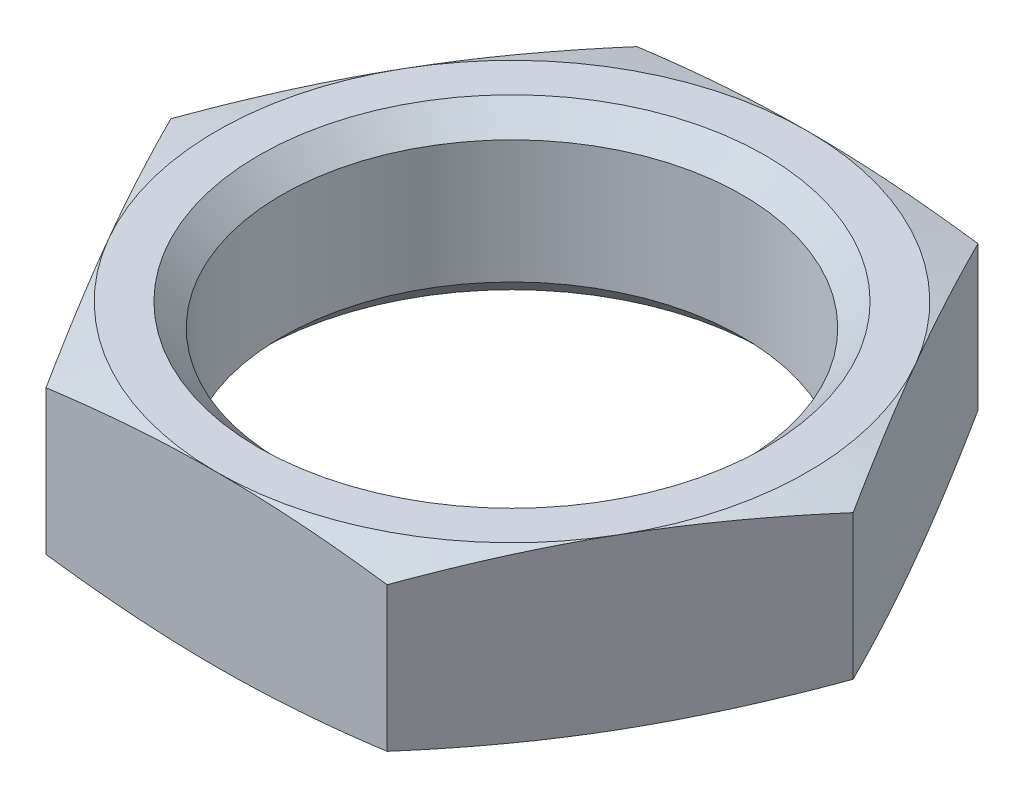
ISO-10303-21;
HEADER;
FILE_DESCRIPTION(('STEP AP214'),'2;1');
FILE_NAME('part.step','',(''),(''),'','','');
FILE_SCHEMA(('AUTOMOTIVE_DESIGN { 1 0 10303 214 1 1 1 1 }'));
ENDSEC;
DATA;
#1=APPLICATION_CONTEXT('core data for automotive mechanical design processes');
#2=APPLICATION_PROTOCOL_DEFINITION('international standard','automotive_design',2000,#1);
#3=PRODUCT_CONTEXT('',#1,'mechanical');
#4=PRODUCT('Part','Part','',(#3));
#5=PRODUCT_RELATED_PRODUCT_CATEGORY('part','',(#4));
#6=PRODUCT_DEFINITION_FORMATION('','',#4);
#7=PRODUCT_DEFINITION_CONTEXT('part definition',#1,'design');
#8=PRODUCT_DEFINITION('design','',#6,#7);
#9=PRODUCT_DEFINITION_SHAPE('','',#8);
#10=(LENGTH_UNIT() NAMED_UNIT(*) SI_UNIT(.MILLI.,.METRE.));
#11=(NAMED_UNIT(*) PLANE_ANGLE_UNIT() SI_UNIT($,.RADIAN.));
#12=(NAMED_UNIT(*) SI_UNIT($,.STERADIAN.) SOLID_ANGLE_UNIT());
#13=UNCERTAINTY_MEASURE_WITH_UNIT(LENGTH_MEASURE(1.E-05),#10,'distance_accuracy_value','');
#14=(GEOMETRIC_REPRESENTATION_CONTEXT(3) GLOBAL_UNCERTAINTY_ASSIGNED_CONTEXT((#13)) GLOBAL_UNIT_ASSIGNED_CONTEXT((#10,
#11,#12)) REPRESENTATION_CONTEXT('',''));
#15=CARTESIAN_POINT('',(0.,0.,0.));
#16=DIRECTION('',(0.,0.,1.));
#17=DIRECTION('',(1.,0.,0.));
#18=AXIS2_PLACEMENT_3D('',#15,#16,#17);
#19=CARTESIAN_POINT('',(0.,22.624871130596,0.));
#20=DIRECTION('',(0.,-1.,0.));
#21=DIRECTION('',(0.,0.,-1.));
#22=AXIS2_PLACEMENT_3D('',#19,#20,#21);
#23=CONICAL_SURFACE('',#22,8.4,1.30899693899546);
#24=CARTESIAN_POINT('',(-10.6911322640009,21.4515481615371,-7.));
#25=CARTESIAN_POINT('',(-10.3735623819273,21.5227195195899,-7.));
#26=CARTESIAN_POINT('',(-10.0557938698741,21.5930204486743,-7.));
#27=CARTESIAN_POINT('',(-9.41976203586877,21.7314116126823,-7.));
#28=CARTESIAN_POINT('',(-9.10149869316679,21.7995017521285,-7.));
#29=CARTESIAN_POINT('',(-8.46409454984814,21.9330607549853,-7.));
#30=CARTESIAN_POINT('',(-8.14495319474251,21.9985269815388,-7.));
#31=CARTESIAN_POINT('',(-7.50600622241134,22.1261315216518,-7.));
#32=CARTESIAN_POINT('',(-7.18620061081572,22.1882698632982,-7.));
#33=CARTESIAN_POINT('',(-6.54836011041523,22.3079472769157,-7.));
#34=CARTESIAN_POINT('',(-6.23033138028991,22.3655190112718,-7.));
#35=CARTESIAN_POINT('',(-5.5934064347611,22.4756361833584,-7.));
#36=CARTESIAN_POINT('',(-5.27451023860448,22.5281817316867,-7.));
#37=CARTESIAN_POINT('',(-4.63578845540351,22.6270634183882,-7.));
#38=CARTESIAN_POINT('',(-4.31596298773532,22.6734003211778,-7.));
#39=CARTESIAN_POINT('',(-3.67529430465846,22.7584992441129,-7.));
#40=CARTESIAN_POINT('',(-3.3544510882966,22.7972612571618,-7.));
#41=CARTESIAN_POINT('',(-2.70812720060484,22.8661127994206,-7.));
#42=CARTESIAN_POINT('',(-2.3826353120585,22.8960985929274,-7.));
#43=CARTESIAN_POINT('',(-1.73083324337082,22.9453291088546,-7.));
#44=CARTESIAN_POINT('',(-1.40452308216818,22.9645740776054,-7.));
#45=CARTESIAN_POINT('',(-0.751557811017229,22.9912004998162,-7.));
#46=CARTESIAN_POINT('',(-0.424902925429233,22.9985873445018,-7.));
#47=CARTESIAN_POINT('',(0.228453821879662,23.0010433607367,-7.));
#48=CARTESIAN_POINT('',(0.555155683559823,22.9961125429043,-7.));
#49=CARTESIAN_POINT('',(1.20933616652606,22.9742105261694,-7.));
#50=CARTESIAN_POINT('',(1.53681329485983,22.9571956279751,-7.));
#51=CARTESIAN_POINT('',(2.19099740166919,22.9120966869003,-7.));
#52=CARTESIAN_POINT('',(2.51770436293296,22.8840123989549,-7.));
#53=CARTESIAN_POINT('',(3.17034538770756,22.8181933032549,-7.));
#54=CARTESIAN_POINT('',(3.49627880618637,22.7804521975215,-7.));
#55=CARTESIAN_POINT('',(4.14709670501514,22.6968898971319,-7.));
#56=CARTESIAN_POINT('',(4.47198118206855,22.6510686771071,-7.));
#57=CARTESIAN_POINT('',(5.09925619444394,22.5560650006586,-7.));
#58=CARTESIAN_POINT('',(5.40171153305506,22.5073061005869,-7.));
#59=CARTESIAN_POINT('',(6.00582502224207,22.4050554163927,-7.));
#60=CARTESIAN_POINT('',(6.30748315083698,22.3515635031432,-7.));
#61=CARTESIAN_POINT('',(6.9101125934313,22.2407127044841,-7.));
#62=CARTESIAN_POINT('',(7.2110838433774,22.1833534725392,-7.));
#63=CARTESIAN_POINT('',(7.8124081922024,22.0654740226152,-7.));
#64=CARTESIAN_POINT('',(8.11276128301989,22.0049537636812,-7.));
#65=CARTESIAN_POINT('',(9.01315912682122,21.8195102166111,-7.));
#66=CARTESIAN_POINT('',(9.61240855747611,21.6907293518093,-7.));
#67=CARTESIAN_POINT('',(10.8093137785155,21.4261960838304,-7.));
#68=CARTESIAN_POINT('',(11.4069696599747,21.2904440884596,-7.));
#69=CARTESIAN_POINT('',(12.5952742494381,21.0153870041733,-7.));
#70=CARTESIAN_POINT('',(13.1859341039434,20.8761299376637,-7.));
#71=CARTESIAN_POINT('',(14.3664297891116,20.5941294395364,-7.));
#72=CARTESIAN_POINT('',(14.9562656045554,20.4513859444052,-7.));
#73=CARTESIAN_POINT('',(16.1345791413491,20.1635007551481,-7.));
#74=CARTESIAN_POINT('',(16.7230576404083,20.0183622378419,-7.));
#75=CARTESIAN_POINT('',(17.8995020368502,19.7261033684098,-7.));
#76=CARTESIAN_POINT('',(18.4874679505085,19.5789830818445,-7.));
#77=CARTESIAN_POINT('',(19.0752552110418,19.4311609668169,-7.));
#78=B_SPLINE_CURVE_WITH_KNOTS('',3,(#24,#25,#26,#27,#28,#29,#30,#31,#32,#33,#34,#35,#36,#37,#38,
#39,#40,#41,#42,#43,#44,#45,#46,#47,#48,#49,#50,#51,#52,#53,#54,#55,#56,#57,#58,#59,#60,#61,#62,
#63,#64,#65,#66,#67,#68,#69,#70,#71,#72,#73,#74,#75,#76,#77),.UNSPECIFIED.,.F.,.F.,(4,2,2,2,2,2,
2,2,2,2,2,2,2,2,2,2,2,2,2,2,2,2,2,2,2,2,4),(0.,0.976346090838124,1.9527342912871,
2.93008027829377,3.9074180153295,4.87697901809727,5.84651868143612,6.81593886390814,
7.78535995458276,8.76581538939093,9.7462483374918,10.7262354112185,11.7062216401572,
12.6897699278962,13.6733399916105,14.6575531618957,15.6417694223039,16.560806166761,
17.4798679922853,18.3990122810862,19.3181684814429,21.1568895489242,22.9955031747617,
24.816049750823,26.6366295171704,28.4549626359596,30.2732357478842),.UNSPECIFIED.);
#79=CARTESIAN_POINT('',(0.,23.,-7.));
#80=VERTEX_POINT('',#79);
#81=CARTESIAN_POINT('',(-4.0414518843274,22.709836809708,-7.));
#82=VERTEX_POINT('',#81);
#83=EDGE_CURVE('E194',#80,#82,#78,.F.);
#84=ORIENTED_EDGE('',*,*,#83,.T.);
#85=CARTESIAN_POINT('',(-4.04133641427356,22.7098058689373,-7.0002));
#86=CARTESIAN_POINT('',(-4.20917732789738,22.7547976495157,-6.70949101001476));
#87=CARTESIAN_POINT('',(-4.37732255633956,22.7956427629535,-6.41825493130264));
#88=CARTESIAN_POINT('',(-4.71420683115924,22.8674037986896,-5.83475425104396));
#89=CARTESIAN_POINT('',(-4.88294609068361,22.898315687944,-5.5424892803162));
#90=CARTESIAN_POINT('',(-5.2199953606491,22.948405659577,-4.95870282008198));
#91=CARTESIAN_POINT('',(-5.38830309196278,22.9676434763867,-4.66718527814003));
#92=CARTESIAN_POINT('',(-5.72513318957669,22.993439419987,-4.08377843555436));
#93=CARTESIAN_POINT('',(-5.89365550803389,23.,-3.79188921777718));
#94=CARTESIAN_POINT('',(-6.23070014494831,23.,-3.20811078222282));
#95=CARTESIAN_POINT('',(-6.39922246340551,22.993439419987,-2.91622156444564));
#96=CARTESIAN_POINT('',(-6.73605256101942,22.9676434763867,-2.33281472185997));
#97=CARTESIAN_POINT('',(-6.9043602923331,22.948405659577,-2.04129717991802));
#98=CARTESIAN_POINT('',(-7.24140956229859,22.898315687944,-1.4575107196838));
#99=CARTESIAN_POINT('',(-7.41014882182296,22.8674037986896,-1.16524574895603));
#100=CARTESIAN_POINT('',(-7.74703309664264,22.7956427629535,-0.58174506869736));
#101=CARTESIAN_POINT('',(-7.91517832508482,22.7547976495157,-0.290508989985233));
#102=CARTESIAN_POINT('',(-8.08301923870864,22.7098058689373,0.000200000000002879));
#103=B_SPLINE_CURVE_WITH_KNOTS('',3,(#85,#86,#87,#88,#89,#90,#91,#92,#93,#94,#95,#96,#97,#98,
#99,#100,#101,#102),.UNSPECIFIED.,.F.,.F.,(4,2,2,2,2,2,2,2,4),(0.,1.0161038968205,
2.03261982791319,3.04388955407877,4.05496356583083,5.06603757758289,6.07730730374847,
7.09382323484116,8.10992713166166),.UNSPECIFIED.);
#104=CARTESIAN_POINT('',(-6.06217782649109,23.,-3.50000000000002));
#105=VERTEX_POINT('',#104);
#106=EDGE_CURVE('E303',#82,#105,#103,.T.);
#107=ORIENTED_EDGE('',*,*,#106,.T.);
#108=CARTESIAN_POINT('',(0.,23.,0.));
#109=DIRECTION('',(0.,1.,0.));
#110=DIRECTION('',(0.,0.,1.));
#111=AXIS2_PLACEMENT_3D('',#108,#109,#110);
#112=CIRCLE('',#111,7.);
#113=EDGE_CURVE('E306',#80,#105,#112,.T.);
#114=ORIENTED_EDGE('',*,*,#113,.F.);
#115=EDGE_LOOP('',(#84,#107,#114));
#116=FACE_BOUND('',#115,.T.);
#117=ADVANCED_FACE('F39',(#116),#23,.T.);
#118=CARTESIAN_POINT('',(-6.06217782649109,23.,3.50000000000003));
#119=VERTEX_POINT('',#118);
#120=EDGE_CURVE('E332',#105,#119,#112,.T.);
#121=ORIENTED_EDGE('',*,*,#120,.F.);
#122=CARTESIAN_POINT('',(-8.0829037686548,22.709836809708,0.));
#123=VERTEX_POINT('',#122);
#124=EDGE_CURVE('E243',#105,#123,#103,.T.);
#125=ORIENTED_EDGE('',*,*,#124,.T.);
#126=CARTESIAN_POINT('',(-8.08301923870864,22.7098058689373,-0.000199999999999112));
#127=CARTESIAN_POINT('',(-7.91517832508482,22.7547976495157,0.290508989985238));
#128=CARTESIAN_POINT('',(-7.74703309664264,22.7956427629535,0.581745068697364));
#129=CARTESIAN_POINT('',(-7.41014882182296,22.8674037986896,1.16524574895603));
#130=CARTESIAN_POINT('',(-7.24140956229859,22.898315687944,1.4575107196838));
#131=CARTESIAN_POINT('',(-6.9043602923331,22.948405659577,2.04129717991802));
#132=CARTESIAN_POINT('',(-6.73605256101942,22.9676434763867,2.33281472185997));
#133=CARTESIAN_POINT('',(-6.39922246340551,22.993439419987,2.91622156444564));
#134=CARTESIAN_POINT('',(-6.23070014494831,23.,3.20811078222282));
#135=CARTESIAN_POINT('',(-5.89365550803389,23.,3.79188921777718));
#136=CARTESIAN_POINT('',(-5.72513318957669,22.993439419987,4.08377843555436));
#137=CARTESIAN_POINT('',(-5.38830309196278,22.9676434763867,4.66718527814003));
#138=CARTESIAN_POINT('',(-5.2199953606491,22.948405659577,4.95870282008198));
#139=CARTESIAN_POINT('',(-4.88294609068361,22.898315687944,5.5424892803162));
#140=CARTESIAN_POINT('',(-4.71420683115924,22.8674037986896,5.83475425104397));
#141=CARTESIAN_POINT('',(-4.37732255633956,22.7956427629535,6.41825493130264));
#142=CARTESIAN_POINT('',(-4.20917732789738,22.7547976495157,6.70949101001476));
#143=CARTESIAN_POINT('',(-4.04133641427356,22.7098058689373,7.0002));
#144=B_SPLINE_CURVE_WITH_KNOTS('',3,(#126,#127,#128,#129,#130,#131,#132,#133,#134,#135,#136,
#137,#138,#139,#140,#141,#142,#143),.UNSPECIFIED.,.F.,.F.,(4,2,2,2,2,2,2,2,4),(0.,
1.01610389682049,2.03261982791319,3.04388955407876,4.05496356583083,5.06603757758289,
6.07730730374846,7.09382323484116,8.10992713166165),.UNSPECIFIED.);
#145=EDGE_CURVE('E241',#123,#119,#144,.T.);
#146=ORIENTED_EDGE('',*,*,#145,.T.);
#147=EDGE_LOOP('',(#121,#125,#146));
#148=FACE_BOUND('',#147,.T.);
#149=ADVANCED_FACE('F293',(#148),#23,.T.);
#150=CARTESIAN_POINT('',(0.,23.,7.));
#151=VERTEX_POINT('',#150);
#152=EDGE_CURVE('E167',#119,#151,#112,.T.);
#153=ORIENTED_EDGE('',*,*,#152,.F.);
#154=CARTESIAN_POINT('',(-4.0414518843274,22.709836809708,7.));
#155=VERTEX_POINT('',#154);
#156=EDGE_CURVE('E234',#119,#155,#144,.T.);
#157=ORIENTED_EDGE('',*,*,#156,.T.);
#158=CARTESIAN_POINT('',(-10.6911322640009,21.4515481615371,7.));
#159=CARTESIAN_POINT('',(-10.3735623819273,21.5227195195899,7.));
#160=CARTESIAN_POINT('',(-10.0557938698741,21.5930204486743,7.));
#161=CARTESIAN_POINT('',(-9.41976203586877,21.7314116126823,7.));
#162=CARTESIAN_POINT('',(-9.10149869316679,21.7995017521285,7.));
#163=CARTESIAN_POINT('',(-8.46409454984814,21.9330607549853,7.));
#164=CARTESIAN_POINT('',(-8.14495319474251,21.9985269815388,7.));
#165=CARTESIAN_POINT('',(-7.50600622241134,22.1261315216518,7.));
#166=CARTESIAN_POINT('',(-7.18620061081572,22.1882698632982,7.));
#167=CARTESIAN_POINT('',(-6.54836011041523,22.3079472769157,7.));
#168=CARTESIAN_POINT('',(-6.23033138028991,22.3655190112718,7.));
#169=CARTESIAN_POINT('',(-5.5934064347611,22.4756361833584,7.));
#170=CARTESIAN_POINT('',(-5.27451023860448,22.5281817316867,7.));
#171=CARTESIAN_POINT('',(-4.63578845540351,22.6270634183882,7.));
#172=CARTESIAN_POINT('',(-4.31596298773532,22.6734003211778,7.));
#173=CARTESIAN_POINT('',(-3.67529430465846,22.7584992441129,7.));
#174=CARTESIAN_POINT('',(-3.3544510882966,22.7972612571618,7.));
#175=CARTESIAN_POINT('',(-2.70812720060484,22.8661127994206,7.));
#176=CARTESIAN_POINT('',(-2.3826353120585,22.8960985929274,7.));
#177=CARTESIAN_POINT('',(-1.73083324337082,22.9453291088546,7.));
#178=CARTESIAN_POINT('',(-1.40452308216818,22.9645740776054,7.));
#179=CARTESIAN_POINT('',(-0.751557811017229,22.9912004998162,7.));
#180=CARTESIAN_POINT('',(-0.424902925429233,22.9985873445018,7.));
#181=CARTESIAN_POINT('',(0.228453821879662,23.0010433607367,7.));
#182=CARTESIAN_POINT('',(0.555155683559823,22.9961125429043,7.));
#183=CARTESIAN_POINT('',(1.20933616652606,22.9742105261694,7.));
#184=CARTESIAN_POINT('',(1.53681329485983,22.9571956279751,7.));
#185=CARTESIAN_POINT('',(2.19099740166919,22.9120966869003,7.));
#186=CARTESIAN_POINT('',(2.51770436293296,22.8840123989549,7.));
#187=CARTESIAN_POINT('',(3.17034538770756,22.8181933032549,7.));
#188=CARTESIAN_POINT('',(3.49627880618637,22.7804521975215,7.));
#189=CARTESIAN_POINT('',(4.14709670501514,22.6968898971319,7.));
#190=CARTESIAN_POINT('',(4.47198118206855,22.6510686771071,7.));
#191=CARTESIAN_POINT('',(5.09925619444394,22.5560650006586,7.));
#192=CARTESIAN_POINT('',(5.40171153305506,22.5073061005869,7.));
#193=CARTESIAN_POINT('',(6.00582502224207,22.4050554163927,7.));
#194=CARTESIAN_POINT('',(6.30748315083698,22.3515635031432,7.));
#195=CARTESIAN_POINT('',(6.9101125934313,22.2407127044841,7.));
#196=CARTESIAN_POINT('',(7.2110838433774,22.1833534725392,7.));
#197=CARTESIAN_POINT('',(7.8124081922024,22.0654740226152,7.));
#198=CARTESIAN_POINT('',(8.11276128301989,22.0049537636812,7.));
#199=CARTESIAN_POINT('',(9.01315912682122,21.8195102166111,7.));
#200=CARTESIAN_POINT('',(9.61240855747611,21.6907293518093,7.));
#201=CARTESIAN_POINT('',(10.8093137785155,21.4261960838304,7.));
#202=CARTESIAN_POINT('',(11.4069696599747,21.2904440884596,7.));
#203=CARTESIAN_POINT('',(12.5952742494381,21.0153870041733,7.));
#204=CARTESIAN_POINT('',(13.1859341039434,20.8761299376637,7.));
#205=CARTESIAN_POINT('',(14.3664297891116,20.5941294395364,7.));
#206=CARTESIAN_POINT('',(14.9562656045554,20.4513859444052,7.));
#207=CARTESIAN_POINT('',(16.1345791413491,20.1635007551481,7.));
#208=CARTESIAN_POINT('',(16.7230576404083,20.0183622378419,7.));
#209=CARTESIAN_POINT('',(17.8995020368502,19.7261033684098,7.));
#210=CARTESIAN_POINT('',(18.4874679505085,19.5789830818445,7.));
#211=CARTESIAN_POINT('',(19.0752552110418,19.4311609668169,7.));
#212=B_SPLINE_CURVE_WITH_KNOTS('',3,(#158,#159,#160,#161,#162,#163,#164,#165,#166,#167,#168,
#169,#170,#171,#172,#173,#174,#175,#176,#177,#178,#179,#180,#181,#182,#183,#184,#185,#186,#187,
#188,#189,#190,#191,#192,#193,#194,#195,#196,#197,#198,#199,#200,#201,#202,#203,#204,#205,#206,
#207,#208,#209,#210,#211),.UNSPECIFIED.,.F.,.F.,(4,2,2,2,2,2,2,2,2,2,2,2,2,2,2,2,2,2,2,2,2,2,2,
2,2,2,4),(0.,0.976346090838124,1.9527342912871,2.93008027829377,3.9074180153295,
4.87697901809727,5.84651868143612,6.81593886390814,7.78535995458276,8.76581538939093,
9.7462483374918,10.7262354112185,11.7062216401572,12.6897699278962,13.6733399916105,
14.6575531618957,15.6417694223039,16.560806166761,17.4798679922853,18.3990122810862,
19.3181684814429,21.1568895489242,22.9955031747617,24.816049750823,26.6366295171704,
28.4549626359596,30.2732357478842),.UNSPECIFIED.);
#213=EDGE_CURVE('E242',#155,#151,#212,.T.);
#214=ORIENTED_EDGE('',*,*,#213,.T.);
#215=EDGE_LOOP('',(#153,#157,#214));
#216=FACE_BOUND('',#215,.T.);
#217=ADVANCED_FACE('F299',(#216),#23,.T.);
#218=CARTESIAN_POINT('',(6.06217782649109,23.,3.50000000000002));
#219=VERTEX_POINT('',#218);
#220=EDGE_CURVE('E138',#151,#219,#112,.T.);
#221=ORIENTED_EDGE('',*,*,#220,.F.);
#222=CARTESIAN_POINT('',(4.0414518843274,22.709836809708,7.));
#223=VERTEX_POINT('',#222);
#224=EDGE_CURVE('E228',#151,#223,#212,.T.);
#225=ORIENTED_EDGE('',*,*,#224,.T.);
#226=CARTESIAN_POINT('',(4.04133641427356,22.7098058689373,7.0002));
#227=CARTESIAN_POINT('',(4.20917732789738,22.7547976495157,6.70949101001476));
#228=CARTESIAN_POINT('',(4.37732255633956,22.7956427629535,6.41825493130264));
#229=CARTESIAN_POINT('',(4.71420683115924,22.8674037986896,5.83475425104396));
#230=CARTESIAN_POINT('',(4.88294609068361,22.898315687944,5.5424892803162));
#231=CARTESIAN_POINT('',(5.2199953606491,22.948405659577,4.95870282008198));
#232=CARTESIAN_POINT('',(5.38830309196278,22.9676434763867,4.66718527814003));
#233=CARTESIAN_POINT('',(5.72513318957669,22.993439419987,4.08377843555436));
#234=CARTESIAN_POINT('',(5.89365550803389,23.,3.79188921777718));
#235=CARTESIAN_POINT('',(6.23070014494831,23.,3.20811078222282));
#236=CARTESIAN_POINT('',(6.39922246340551,22.993439419987,2.91622156444564));
#237=CARTESIAN_POINT('',(6.73605256101942,22.9676434763867,2.33281472185997));
#238=CARTESIAN_POINT('',(6.9043602923331,22.948405659577,2.04129717991802));
#239=CARTESIAN_POINT('',(7.24140956229859,22.898315687944,1.4575107196838));
#240=CARTESIAN_POINT('',(7.41014882182296,22.8674037986896,1.16524574895603));
#241=CARTESIAN_POINT('',(7.74703309664264,22.7956427629535,0.58174506869736));
#242=CARTESIAN_POINT('',(7.91517832508482,22.7547976495157,0.290508989985233));
#243=CARTESIAN_POINT('',(8.08301923870864,22.7098058689373,-0.000200000000002879));
#244=B_SPLINE_CURVE_WITH_KNOTS('',3,(#226,#227,#228,#229,#230,#231,#232,#233,#234,#235,#236,
#237,#238,#239,#240,#241,#242,#243),.UNSPECIFIED.,.F.,.F.,(4,2,2,2,2,2,2,2,4),(0.,
1.0161038968205,2.03261982791319,3.04388955407877,4.05496356583083,5.06603757758289,
6.07730730374847,7.09382323484116,8.10992713166166),.UNSPECIFIED.);
#245=EDGE_CURVE('E318',#223,#219,#244,.T.);
#246=ORIENTED_EDGE('',*,*,#245,.T.);
#247=EDGE_LOOP('',(#221,#225,#246));
#248=FACE_BOUND('',#247,.T.);
#249=ADVANCED_FACE('F333',(#248),#23,.T.);
#250=CARTESIAN_POINT('',(6.06217782649109,23.,-3.50000000000003));
#251=VERTEX_POINT('',#250);
#252=EDGE_CURVE('E172',#219,#251,#112,.T.);
#253=ORIENTED_EDGE('',*,*,#252,.F.);
#254=CARTESIAN_POINT('',(8.0829037686548,22.709836809708,0.));
#255=VERTEX_POINT('',#254);
#256=EDGE_CURVE('E222',#219,#255,#244,.T.);
#257=ORIENTED_EDGE('',*,*,#256,.T.);
#258=CARTESIAN_POINT('',(8.08301923870864,22.7098058689373,0.000199999999999112));
#259=CARTESIAN_POINT('',(7.91517832508482,22.7547976495157,-0.290508989985238));
#260=CARTESIAN_POINT('',(7.74703309664264,22.7956427629535,-0.581745068697364));
#261=CARTESIAN_POINT('',(7.41014882182296,22.8674037986896,-1.16524574895603));
#262=CARTESIAN_POINT('',(7.24140956229859,22.898315687944,-1.4575107196838));
#263=CARTESIAN_POINT('',(6.9043602923331,22.948405659577,-2.04129717991802));
#264=CARTESIAN_POINT('',(6.73605256101942,22.9676434763867,-2.33281472185997));
#265=CARTESIAN_POINT('',(6.39922246340551,22.993439419987,-2.91622156444564));
#266=CARTESIAN_POINT('',(6.23070014494831,23.,-3.20811078222282));
#267=CARTESIAN_POINT('',(5.89365550803389,23.,-3.79188921777718));
#268=CARTESIAN_POINT('',(5.72513318957669,22.993439419987,-4.08377843555436));
#269=CARTESIAN_POINT('',(5.38830309196278,22.9676434763867,-4.66718527814003));
#270=CARTESIAN_POINT('',(5.2199953606491,22.948405659577,-4.95870282008198));
#271=CARTESIAN_POINT('',(4.88294609068361,22.898315687944,-5.5424892803162));
#272=CARTESIAN_POINT('',(4.71420683115924,22.8674037986896,-5.83475425104397));
#273=CARTESIAN_POINT('',(4.37732255633956,22.7956427629535,-6.41825493130264));
#274=CARTESIAN_POINT('',(4.20917732789738,22.7547976495157,-6.70949101001476));
#275=CARTESIAN_POINT('',(4.04133641427356,22.7098058689373,-7.0002));
#276=B_SPLINE_CURVE_WITH_KNOTS('',3,(#258,#259,#260,#261,#262,#263,#264,#265,#266,#267,#268,
#269,#270,#271,#272,#273,#274,#275),.UNSPECIFIED.,.F.,.F.,(4,2,2,2,2,2,2,2,4),(0.,
1.01610389682049,2.03261982791319,3.04388955407876,4.05496356583083,5.06603757758289,
6.07730730374846,7.09382323484116,8.10992713166165),.UNSPECIFIED.);
#277=EDGE_CURVE('E313',#255,#251,#276,.T.);
#278=ORIENTED_EDGE('',*,*,#277,.T.);
#279=EDGE_LOOP('',(#253,#257,#278));
#280=FACE_BOUND('',#279,.T.);
#281=ADVANCED_FACE('F215',(#280),#23,.T.);
#282=CARTESIAN_POINT('',(0.,19.,0.));
#283=DIRECTION('',(0.,1.,0.));
#284=DIRECTION('',(0.,0.,1.));
#285=AXIS2_PLACEMENT_3D('',#282,#283,#284);
#286=CONICAL_SURFACE('',#285,7.,1.30899693899546);
#287=CARTESIAN_POINT('',(8.08301923870864,19.2901941310627,-0.000200000000001046));
#288=CARTESIAN_POINT('',(7.91517832508482,19.2452023504843,0.290508989985236));
#289=CARTESIAN_POINT('',(7.74703309664264,19.2043572370465,0.581745068697362));
#290=CARTESIAN_POINT('',(7.41014882182296,19.1325962013104,1.16524574895603));
#291=CARTESIAN_POINT('',(7.24140956229859,19.101684312056,1.4575107196838));
#292=CARTESIAN_POINT('',(6.9043602923331,19.051594340423,2.04129717991802));
#293=CARTESIAN_POINT('',(6.73605256101942,19.0323565236133,2.33281472185997));
#294=CARTESIAN_POINT('',(6.39922246340551,19.006560580013,2.91622156444564));
#295=CARTESIAN_POINT('',(6.23070014494831,19.,3.20811078222282));
#296=CARTESIAN_POINT('',(5.89365550803389,19.,3.79188921777718));
#297=CARTESIAN_POINT('',(5.72513318957669,19.006560580013,4.08377843555436));
#298=CARTESIAN_POINT('',(5.38830309196278,19.0323565236133,4.66718527814003));
#299=CARTESIAN_POINT('',(5.2199953606491,19.051594340423,4.95870282008198));
#300=CARTESIAN_POINT('',(4.88294609068361,19.101684312056,5.5424892803162));
#301=CARTESIAN_POINT('',(4.71420683115924,19.1325962013104,5.83475425104396));
#302=CARTESIAN_POINT('',(4.37732255633956,19.2043572370465,6.41825493130264));
#303=CARTESIAN_POINT('',(4.20917732789738,19.2452023504843,6.70949101001476));
#304=CARTESIAN_POINT('',(4.04133641427356,19.2901941310627,7.0002));
#305=B_SPLINE_CURVE_WITH_KNOTS('',3,(#287,#288,#289,#290,#291,#292,#293,#294,#295,#296,#297,
#298,#299,#300,#301,#302,#303,#304),.UNSPECIFIED.,.F.,.F.,(4,2,2,2,2,2,2,2,4),(0.,
1.01610389682049,2.03261982791319,3.04388955407877,4.05496356583083,5.06603757758289,
6.07730730374846,7.09382323484116,8.10992713166165),.UNSPECIFIED.);
#306=CARTESIAN_POINT('',(6.06217782649109,19.,3.50000000000002));
#307=VERTEX_POINT('',#306);
#308=CARTESIAN_POINT('',(4.0414518843274,19.290163190292,7.));
#309=VERTEX_POINT('',#308);
#310=EDGE_CURVE('E275',#307,#309,#305,.T.);
#311=ORIENTED_EDGE('',*,*,#310,.T.);
#312=CARTESIAN_POINT('',(-10.6911322640009,20.5484518384629,7.));
#313=CARTESIAN_POINT('',(-10.3735623819273,20.4772804804101,7.));
#314=CARTESIAN_POINT('',(-10.0557938698741,20.4069795513257,7.));
#315=CARTESIAN_POINT('',(-9.41976203586877,20.2685883873177,7.));
#316=CARTESIAN_POINT('',(-9.1014986931668,20.2004982478715,7.));
#317=CARTESIAN_POINT('',(-8.46409454984815,20.0669392450147,7.));
#318=CARTESIAN_POINT('',(-8.14495319474251,20.0014730184612,7.));
#319=CARTESIAN_POINT('',(-7.50600622241134,19.8738684783482,7.));
#320=CARTESIAN_POINT('',(-7.18620061081572,19.8117301367018,7.));
#321=CARTESIAN_POINT('',(-6.54836011041523,19.6920527230843,7.));
#322=CARTESIAN_POINT('',(-6.23033138028991,19.6344809887282,7.));
#323=CARTESIAN_POINT('',(-5.5934064347611,19.5243638166416,7.));
#324=CARTESIAN_POINT('',(-5.27451023860448,19.4718182683133,7.));
#325=CARTESIAN_POINT('',(-4.63578845540351,19.3729365816118,7.));
#326=CARTESIAN_POINT('',(-4.31596298773532,19.3265996788222,7.));
#327=CARTESIAN_POINT('',(-3.67529430465846,19.2415007558871,7.));
#328=CARTESIAN_POINT('',(-3.3544510882966,19.2027387428382,7.));
#329=CARTESIAN_POINT('',(-2.70812720060484,19.1338872005794,7.));
#330=CARTESIAN_POINT('',(-2.3826353120585,19.1039014070726,7.));
#331=CARTESIAN_POINT('',(-1.73083324337082,19.0546708911454,7.));
#332=CARTESIAN_POINT('',(-1.40452308216818,19.0354259223946,7.));
#333=CARTESIAN_POINT('',(-0.751557811017229,19.0087995001838,7.));
#334=CARTESIAN_POINT('',(-0.424902925429233,19.0014126554982,7.));
#335=CARTESIAN_POINT('',(0.228453821879662,18.9989566392633,7.));
#336=CARTESIAN_POINT('',(0.555155683559823,19.0038874570957,7.));
#337=CARTESIAN_POINT('',(1.20933616652606,19.0257894738306,7.));
#338=CARTESIAN_POINT('',(1.53681329485983,19.0428043720249,7.));
#339=CARTESIAN_POINT('',(2.19099740166919,19.0879033130997,7.));
#340=CARTESIAN_POINT('',(2.51770436293296,19.1159876010451,7.));
#341=CARTESIAN_POINT('',(3.17034538770756,19.1818066967451,7.));
#342=CARTESIAN_POINT('',(3.49627880618637,19.2195478024785,7.));
#343=CARTESIAN_POINT('',(4.14709670501514,19.3031101028681,7.));
#344=CARTESIAN_POINT('',(4.47198118206855,19.3489313228929,7.));
#345=CARTESIAN_POINT('',(5.09925619444394,19.4439349993414,7.));
#346=CARTESIAN_POINT('',(5.40171153305506,19.4926938994131,7.));
#347=CARTESIAN_POINT('',(6.00582502224207,19.5949445836073,7.));
#348=CARTESIAN_POINT('',(6.30748315083698,19.6484364968568,7.));
#349=CARTESIAN_POINT('',(6.9101125934313,19.7592872955159,7.));
#350=CARTESIAN_POINT('',(7.2110838433774,19.8166465274608,7.));
#351=CARTESIAN_POINT('',(7.8124081922024,19.9345259773848,7.));
#352=CARTESIAN_POINT('',(8.11276128301989,19.9950462363188,7.));
#353=CARTESIAN_POINT('',(9.01315912682122,20.1804897833889,7.));
#354=CARTESIAN_POINT('',(9.61240855747611,20.3092706481907,7.));
#355=CARTESIAN_POINT('',(10.8093137785155,20.5738039161696,7.));
#356=CARTESIAN_POINT('',(11.4069696599747,20.7095559115404,7.));
#357=CARTESIAN_POINT('',(12.5952742494381,20.9846129958267,7.));
#358=CARTESIAN_POINT('',(13.1859341039434,21.1238700623363,7.));
#359=CARTESIAN_POINT('',(14.3664297891116,21.4058705604636,7.));
#360=CARTESIAN_POINT('',(14.9562656045554,21.5486140555948,7.));
#361=CARTESIAN_POINT('',(16.1345791413491,21.8364992448519,7.));
#362=CARTESIAN_POINT('',(16.7230576404083,21.9816377621581,7.));
#363=CARTESIAN_POINT('',(17.8995020368502,22.2738966315902,7.));
#364=CARTESIAN_POINT('',(18.4874679505085,22.4210169181554,7.));
#365=CARTESIAN_POINT('',(19.0752552110418,22.5688390331831,7.));
#366=B_SPLINE_CURVE_WITH_KNOTS('',3,(#312,#313,#314,#315,#316,#317,#318,#319,#320,#321,#322,
#323,#324,#325,#326,#327,#328,#329,#330,#331,#332,#333,#334,#335,#336,#337,#338,#339,#340,#341,
#342,#343,#344,#345,#346,#347,#348,#349,#350,#351,#352,#353,#354,#355,#356,#357,#358,#359,#360,
#361,#362,#363,#364,#365),.UNSPECIFIED.,.F.,.F.,(4,2,2,2,2,2,2,2,2,2,2,2,2,2,2,2,2,2,2,2,2,2,2,
2,2,2,4),(0.,0.976346090838124,1.9527342912871,2.93008027829377,3.9074180153295,
4.87697901809727,5.84651868143612,6.81593886390814,7.78535995458276,8.76581538939093,
9.7462483374918,10.7262354112185,11.7062216401572,12.6897699278962,13.6733399916105,
14.6575531618957,15.6417694223039,16.560806166761,17.4798679922853,18.3990122810862,
19.3181684814429,21.1568895489242,22.9955031747617,24.816049750823,26.6366295171704,
28.4549626359597,30.2732357478843),.UNSPECIFIED.);
#367=CARTESIAN_POINT('',(0.,19.,7.));
#368=VERTEX_POINT('',#367);
#369=EDGE_CURVE('E11',#309,#368,#366,.F.);
#370=ORIENTED_EDGE('',*,*,#369,.T.);
#371=CARTESIAN_POINT('',(0.,19.,0.));
#372=DIRECTION('',(0.,1.,0.));
#373=DIRECTION('',(0.,0.,1.));
#374=AXIS2_PLACEMENT_3D('',#371,#372,#373);
#375=CIRCLE('',#374,7.);
#376=EDGE_CURVE('E163',#368,#307,#375,.T.);
#377=ORIENTED_EDGE('',*,*,#376,.T.);
#378=EDGE_LOOP('',(#311,#370,#377));
#379=FACE_BOUND('',#378,.T.);
#380=ADVANCED_FACE('F339',(#379),#286,.T.);
#381=CARTESIAN_POINT('',(-6.06217782649109,19.,3.50000000000003));
#382=VERTEX_POINT('',#381);
#383=EDGE_CURVE('E168',#382,#368,#375,.T.);
#384=ORIENTED_EDGE('',*,*,#383,.T.);
#385=CARTESIAN_POINT('',(-4.0414518843274,19.290163190292,7.));
#386=VERTEX_POINT('',#385);
#387=EDGE_CURVE('E43',#368,#386,#366,.F.);
#388=ORIENTED_EDGE('',*,*,#387,.T.);
#389=CARTESIAN_POINT('',(-4.04133641427356,19.2901941310627,7.0002));
#390=CARTESIAN_POINT('',(-4.20917732789738,19.2452023504843,6.70949101001476));
#391=CARTESIAN_POINT('',(-4.37732255633956,19.2043572370465,6.41825493130264));
#392=CARTESIAN_POINT('',(-4.71420683115924,19.1325962013104,5.83475425104397));
#393=CARTESIAN_POINT('',(-4.88294609068361,19.101684312056,5.5424892803162));
#394=CARTESIAN_POINT('',(-5.2199953606491,19.051594340423,4.95870282008198));
#395=CARTESIAN_POINT('',(-5.38830309196278,19.0323565236133,4.66718527814003));
#396=CARTESIAN_POINT('',(-5.72513318957669,19.006560580013,4.08377843555436));
#397=CARTESIAN_POINT('',(-5.8936555080339,19.,3.79188921777718));
#398=CARTESIAN_POINT('',(-6.23070014494831,19.,3.20811078222282));
#399=CARTESIAN_POINT('',(-6.39922246340551,19.006560580013,2.91622156444564));
#400=CARTESIAN_POINT('',(-6.73605256101942,19.0323565236133,2.33281472185997));
#401=CARTESIAN_POINT('',(-6.9043602923331,19.051594340423,2.04129717991802));
#402=CARTESIAN_POINT('',(-7.24140956229859,19.101684312056,1.4575107196838));
#403=CARTESIAN_POINT('',(-7.41014882182296,19.1325962013104,1.16524574895603));
#404=CARTESIAN_POINT('',(-7.74703309664264,19.2043572370465,0.581745068697363));
#405=CARTESIAN_POINT('',(-7.91517832508482,19.2452023504843,0.290508989985237));
#406=CARTESIAN_POINT('',(-8.08301923870864,19.2901941310627,-0.000200000000000239));
#407=B_SPLINE_CURVE_WITH_KNOTS('',3,(#389,#390,#391,#392,#393,#394,#395,#396,#397,#398,#399,
#400,#401,#402,#403,#404,#405,#406),.UNSPECIFIED.,.F.,.F.,(4,2,2,2,2,2,2,2,4),(0.,
1.01610389682049,2.03261982791319,3.04388955407876,4.05496356583083,5.06603757758289,
6.07730730374846,7.09382323484116,8.10992713166165),.UNSPECIFIED.);
#408=EDGE_CURVE('E267',#386,#382,#407,.T.);
#409=ORIENTED_EDGE('',*,*,#408,.T.);
#410=EDGE_LOOP('',(#384,#388,#409));
#411=FACE_BOUND('',#410,.T.);
#412=ADVANCED_FACE('F414',(#411),#286,.T.);
#413=CARTESIAN_POINT('',(-6.06217782649109,19.,-3.50000000000002));
#414=VERTEX_POINT('',#413);
#415=EDGE_CURVE('E159',#414,#382,#375,.T.);
#416=ORIENTED_EDGE('',*,*,#415,.T.);
#417=CARTESIAN_POINT('',(-8.0829037686548,19.290163190292,0.));
#418=VERTEX_POINT('',#417);
#419=EDGE_CURVE('E260',#382,#418,#407,.T.);
#420=ORIENTED_EDGE('',*,*,#419,.T.);
#421=CARTESIAN_POINT('',(-8.08301923870864,19.2901941310627,0.000200000000001046));
#422=CARTESIAN_POINT('',(-7.91517832508482,19.2452023504843,-0.290508989985236));
#423=CARTESIAN_POINT('',(-7.74703309664264,19.2043572370465,-0.581745068697362));
#424=CARTESIAN_POINT('',(-7.41014882182296,19.1325962013104,-1.16524574895603));
#425=CARTESIAN_POINT('',(-7.24140956229859,19.101684312056,-1.4575107196838));
#426=CARTESIAN_POINT('',(-6.9043602923331,19.051594340423,-2.04129717991802));
#427=CARTESIAN_POINT('',(-6.73605256101942,19.0323565236133,-2.33281472185997));
#428=CARTESIAN_POINT('',(-6.39922246340551,19.006560580013,-2.91622156444564));
#429=CARTESIAN_POINT('',(-6.23070014494831,19.,-3.20811078222282));
#430=CARTESIAN_POINT('',(-5.89365550803389,19.,-3.79188921777718));
#431=CARTESIAN_POINT('',(-5.72513318957669,19.006560580013,-4.08377843555436));
#432=CARTESIAN_POINT('',(-5.38830309196278,19.0323565236133,-4.66718527814003));
#433=CARTESIAN_POINT('',(-5.2199953606491,19.051594340423,-4.95870282008198));
#434=CARTESIAN_POINT('',(-4.88294609068361,19.101684312056,-5.5424892803162));
#435=CARTESIAN_POINT('',(-4.71420683115924,19.1325962013104,-5.83475425104396));
#436=CARTESIAN_POINT('',(-4.37732255633956,19.2043572370465,-6.41825493130264));
#437=CARTESIAN_POINT('',(-4.20917732789738,19.2452023504843,-6.70949101001476));
#438=CARTESIAN_POINT('',(-4.04133641427356,19.2901941310627,-7.0002));
#439=B_SPLINE_CURVE_WITH_KNOTS('',3,(#421,#422,#423,#424,#425,#426,#427,#428,#429,#430,#431,
#432,#433,#434,#435,#436,#437,#438),.UNSPECIFIED.,.F.,.F.,(4,2,2,2,2,2,2,2,4),(0.,
1.01610389682049,2.03261982791319,3.04388955407877,4.05496356583083,5.06603757758289,
6.07730730374846,7.09382323484116,8.10992713166165),.UNSPECIFIED.);
#440=EDGE_CURVE('E440',#418,#414,#439,.T.);
#441=ORIENTED_EDGE('',*,*,#440,.T.);
#442=EDGE_LOOP('',(#416,#420,#441));
#443=FACE_BOUND('',#442,.T.);
#444=ADVANCED_FACE('F407',(#443),#286,.T.);
#445=CARTESIAN_POINT('',(4.04133641427356,19.2901941310627,-7.0002));
#446=CARTESIAN_POINT('',(4.20917732789738,19.2452023504843,-6.70949101001476));
#447=CARTESIAN_POINT('',(4.37732255633956,19.2043572370465,-6.41825493130264));
#448=CARTESIAN_POINT('',(4.71420683115924,19.1325962013104,-5.83475425104397));
#449=CARTESIAN_POINT('',(4.88294609068361,19.101684312056,-5.5424892803162));
#450=CARTESIAN_POINT('',(5.2199953606491,19.051594340423,-4.95870282008198));
#451=CARTESIAN_POINT('',(5.38830309196278,19.0323565236133,-4.66718527814003));
#452=CARTESIAN_POINT('',(5.72513318957669,19.006560580013,-4.08377843555436));
#453=CARTESIAN_POINT('',(5.8936555080339,19.,-3.79188921777718));
#454=CARTESIAN_POINT('',(6.23070014494831,19.,-3.20811078222282));
#455=CARTESIAN_POINT('',(6.39922246340551,19.006560580013,-2.91622156444564));
#456=CARTESIAN_POINT('',(6.73605256101942,19.0323565236133,-2.33281472185997));
#457=CARTESIAN_POINT('',(6.9043602923331,19.051594340423,-2.04129717991802));
#458=CARTESIAN_POINT('',(7.24140956229859,19.101684312056,-1.4575107196838));
#459=CARTESIAN_POINT('',(7.41014882182296,19.1325962013104,-1.16524574895603));
#460=CARTESIAN_POINT('',(7.74703309664264,19.2043572370465,-0.581745068697363));
#461=CARTESIAN_POINT('',(7.91517832508482,19.2452023504843,-0.290508989985237));
#462=CARTESIAN_POINT('',(8.08301923870864,19.2901941310627,0.000200000000000239));
#463=B_SPLINE_CURVE_WITH_KNOTS('',3,(#445,#446,#447,#448,#449,#450,#451,#452,#453,#454,#455,
#456,#457,#458,#459,#460,#461,#462),.UNSPECIFIED.,.F.,.F.,(4,2,2,2,2,2,2,2,4),(0.,
1.01610389682049,2.03261982791319,3.04388955407876,4.05496356583083,5.06603757758289,
6.07730730374846,7.09382323484116,8.10992713166165),.UNSPECIFIED.);
#464=CARTESIAN_POINT('',(6.06217782649109,19.,-3.50000000000003));
#465=VERTEX_POINT('',#464);
#466=CARTESIAN_POINT('',(8.0829037686548,19.290163190292,0.));
#467=VERTEX_POINT('',#466);
#468=EDGE_CURVE('E274',#465,#467,#463,.T.);
#469=ORIENTED_EDGE('',*,*,#468,.T.);
#470=EDGE_CURVE('E268',#467,#307,#305,.T.);
#471=ORIENTED_EDGE('',*,*,#470,.T.);
#472=EDGE_CURVE('E162',#307,#465,#375,.T.);
#473=ORIENTED_EDGE('',*,*,#472,.T.);
#474=EDGE_LOOP('',(#469,#471,#473));
#475=FACE_BOUND('',#474,.T.);
#476=ADVANCED_FACE('F400',(#475),#286,.T.);
#477=CARTESIAN_POINT('',(0.,19.,-7.));
#478=VERTEX_POINT('',#477);
#479=EDGE_CURVE('E145',#478,#414,#375,.T.);
#480=ORIENTED_EDGE('',*,*,#479,.T.);
#481=CARTESIAN_POINT('',(-4.0414518843274,19.290163190292,-7.));
#482=VERTEX_POINT('',#481);
#483=EDGE_CURVE('E146',#414,#482,#439,.T.);
#484=ORIENTED_EDGE('',*,*,#483,.T.);
#485=CARTESIAN_POINT('',(-10.6911322640009,20.5484518384629,-7.));
#486=CARTESIAN_POINT('',(-10.3735623819273,20.4772804804101,-7.));
#487=CARTESIAN_POINT('',(-10.0557938698741,20.4069795513257,-7.));
#488=CARTESIAN_POINT('',(-9.41976203586877,20.2685883873177,-7.));
#489=CARTESIAN_POINT('',(-9.1014986931668,20.2004982478715,-7.));
#490=CARTESIAN_POINT('',(-8.46409454984815,20.0669392450147,-7.));
#491=CARTESIAN_POINT('',(-8.14495319474251,20.0014730184612,-7.));
#492=CARTESIAN_POINT('',(-7.50600622241134,19.8738684783482,-7.));
#493=CARTESIAN_POINT('',(-7.18620061081572,19.8117301367018,-7.));
#494=CARTESIAN_POINT('',(-6.54836011041523,19.6920527230843,-7.));
#495=CARTESIAN_POINT('',(-6.23033138028991,19.6344809887282,-7.));
#496=CARTESIAN_POINT('',(-5.5934064347611,19.5243638166416,-7.));
#497=CARTESIAN_POINT('',(-5.27451023860448,19.4718182683133,-7.));
#498=CARTESIAN_POINT('',(-4.63578845540351,19.3729365816118,-7.));
#499=CARTESIAN_POINT('',(-4.31596298773532,19.3265996788222,-7.));
#500=CARTESIAN_POINT('',(-3.67529430465846,19.2415007558871,-7.));
#501=CARTESIAN_POINT('',(-3.3544510882966,19.2027387428382,-7.));
#502=CARTESIAN_POINT('',(-2.70812720060484,19.1338872005794,-7.));
#503=CARTESIAN_POINT('',(-2.3826353120585,19.1039014070726,-7.));
#504=CARTESIAN_POINT('',(-1.73083324337082,19.0546708911454,-7.));
#505=CARTESIAN_POINT('',(-1.40452308216818,19.0354259223946,-7.));
#506=CARTESIAN_POINT('',(-0.751557811017229,19.0087995001838,-7.));
#507=CARTESIAN_POINT('',(-0.424902925429233,19.0014126554982,-7.));
#508=CARTESIAN_POINT('',(0.228453821879662,18.9989566392633,-7.));
#509=CARTESIAN_POINT('',(0.555155683559823,19.0038874570957,-7.));
#510=CARTESIAN_POINT('',(1.20933616652606,19.0257894738306,-7.));
#511=CARTESIAN_POINT('',(1.53681329485983,19.0428043720249,-7.));
#512=CARTESIAN_POINT('',(2.19099740166919,19.0879033130997,-7.));
#513=CARTESIAN_POINT('',(2.51770436293296,19.1159876010451,-7.));
#514=CARTESIAN_POINT('',(3.17034538770756,19.1818066967451,-7.));
#515=CARTESIAN_POINT('',(3.49627880618637,19.2195478024785,-7.));
#516=CARTESIAN_POINT('',(4.14709670501514,19.3031101028681,-7.));
#517=CARTESIAN_POINT('',(4.47198118206855,19.3489313228929,-7.));
#518=CARTESIAN_POINT('',(5.09925619444394,19.4439349993414,-7.));
#519=CARTESIAN_POINT('',(5.40171153305506,19.4926938994131,-7.));
#520=CARTESIAN_POINT('',(6.00582502224207,19.5949445836073,-7.));
#521=CARTESIAN_POINT('',(6.30748315083698,19.6484364968568,-7.));
#522=CARTESIAN_POINT('',(6.9101125934313,19.7592872955159,-7.));
#523=CARTESIAN_POINT('',(7.2110838433774,19.8166465274608,-7.));
#524=CARTESIAN_POINT('',(7.8124081922024,19.9345259773848,-7.));
#525=CARTESIAN_POINT('',(8.11276128301989,19.9950462363188,-7.));
#526=CARTESIAN_POINT('',(9.01315912682122,20.1804897833889,-7.));
#527=CARTESIAN_POINT('',(9.61240855747611,20.3092706481907,-7.));
#528=CARTESIAN_POINT('',(10.8093137785155,20.5738039161696,-7.));
#529=CARTESIAN_POINT('',(11.4069696599747,20.7095559115404,-7.));
#530=CARTESIAN_POINT('',(12.5952742494381,20.9846129958267,-7.));
#531=CARTESIAN_POINT('',(13.1859341039434,21.1238700623363,-7.));
#532=CARTESIAN_POINT('',(14.3664297891116,21.4058705604636,-7.));
#533=CARTESIAN_POINT('',(14.9562656045554,21.5486140555948,-7.));
#534=CARTESIAN_POINT('',(16.1345791413491,21.8364992448519,-7.));
#535=CARTESIAN_POINT('',(16.7230576404083,21.9816377621581,-7.));
#536=CARTESIAN_POINT('',(17.8995020368502,22.2738966315902,-7.));
#537=CARTESIAN_POINT('',(18.4874679505085,22.4210169181554,-7.));
#538=CARTESIAN_POINT('',(19.0752552110418,22.5688390331831,-7.));
#539=B_SPLINE_CURVE_WITH_KNOTS('',3,(#485,#486,#487,#488,#489,#490,#491,#492,#493,#494,#495,
#496,#497,#498,#499,#500,#501,#502,#503,#504,#505,#506,#507,#508,#509,#510,#511,#512,#513,#514,
#515,#516,#517,#518,#519,#520,#521,#522,#523,#524,#525,#526,#527,#528,#529,#530,#531,#532,#533,
#534,#535,#536,#537,#538),.UNSPECIFIED.,.F.,.F.,(4,2,2,2,2,2,2,2,2,2,2,2,2,2,2,2,2,2,2,2,2,2,2,
2,2,2,4),(0.,0.976346090838124,1.9527342912871,2.93008027829377,3.9074180153295,
4.87697901809727,5.84651868143612,6.81593886390814,7.78535995458276,8.76581538939093,
9.7462483374918,10.7262354112185,11.7062216401572,12.6897699278962,13.6733399916105,
14.6575531618957,15.6417694223039,16.560806166761,17.4798679922853,18.3990122810862,
19.3181684814429,21.1568895489242,22.9955031747617,24.816049750823,26.6366295171704,
28.4549626359597,30.2732357478843),.UNSPECIFIED.);
#540=EDGE_CURVE('E134',#482,#478,#539,.T.);
#541=ORIENTED_EDGE('',*,*,#540,.T.);
#542=EDGE_LOOP('',(#480,#484,#541));
#543=FACE_BOUND('',#542,.T.);
#544=ADVANCED_FACE('F144',(#543),#286,.T.);
#545=CARTESIAN_POINT('',(0.,23.,0.));
#546=DIRECTION('',(0.,-1.,0.));
#547=DIRECTION('',(0.,0.,-1.));
#548=AXIS2_PLACEMENT_3D('',#545,#546,#547);
#549=PLANE('',#548);
#550=ORIENTED_EDGE('',*,*,#220,.T.);
#551=ORIENTED_EDGE('',*,*,#252,.T.);
#552=EDGE_CURVE('E311',#251,#80,#112,.T.);
#553=ORIENTED_EDGE('',*,*,#552,.T.);
#554=ORIENTED_EDGE('',*,*,#113,.T.);
#555=ORIENTED_EDGE('',*,*,#120,.T.);
#556=ORIENTED_EDGE('',*,*,#152,.T.);
#557=EDGE_LOOP('',(#550,#551,#553,#554,#555,#556));
#558=FACE_BOUND('',#557,.T.);
#559=CARTESIAN_POINT('',(0.,23.,0.));
#560=DIRECTION('',(0.,1.,0.));
#561=DIRECTION('',(0.,0.,1.));
#562=AXIS2_PLACEMENT_3D('',#559,#560,#561);
#563=CIRCLE('',#562,6.);
#564=CARTESIAN_POINT('',(0.,23.,6.));
#565=VERTEX_POINT('',#564);
#566=EDGE_CURVE('E169',#565,#565,#563,.T.);
#567=ORIENTED_EDGE('',*,*,#566,.F.);
#568=EDGE_LOOP('',(#567));
#569=FACE_BOUND('',#568,.T.);
#570=ADVANCED_FACE('F41',(#558,#569),#549,.F.);
#571=CARTESIAN_POINT('',(7.,19.,0.));
#572=DIRECTION('',(0.,1.,0.));
#573=DIRECTION('',(0.,0.,1.));
#574=AXIS2_PLACEMENT_3D('',#571,#572,#573);
#575=PLANE('',#574);
#576=ORIENTED_EDGE('',*,*,#376,.F.);
#577=ORIENTED_EDGE('',*,*,#383,.F.);
#578=ORIENTED_EDGE('',*,*,#415,.F.);
#579=ORIENTED_EDGE('',*,*,#479,.F.);
#580=EDGE_CURVE('E155',#465,#478,#375,.T.);
#581=ORIENTED_EDGE('',*,*,#580,.F.);
#582=ORIENTED_EDGE('',*,*,#472,.F.);
#583=EDGE_LOOP('',(#576,#577,#578,#579,#581,#582));
#584=FACE_BOUND('',#583,.T.);
#585=CARTESIAN_POINT('',(0.,19.,0.));
#586=DIRECTION('',(0.,1.,0.));
#587=DIRECTION('',(0.,0.,1.));
#588=AXIS2_PLACEMENT_3D('',#585,#586,#587);
#589=CIRCLE('',#588,6.);
#590=CARTESIAN_POINT('',(0.,19.,6.));
#591=VERTEX_POINT('',#590);
#592=EDGE_CURVE('E455',#591,#591,#589,.T.);
#593=ORIENTED_EDGE('',*,*,#592,.T.);
#594=EDGE_LOOP('',(#593));
#595=FACE_BOUND('',#594,.T.);
#596=ADVANCED_FACE('F152',(#584,#595),#575,.F.);
#597=ORIENTED_EDGE('',*,*,#552,.F.);
#598=CARTESIAN_POINT('',(4.0414518843274,22.709836809708,-7.));
#599=VERTEX_POINT('',#598);
#600=EDGE_CURVE('E205',#251,#599,#276,.T.);
#601=ORIENTED_EDGE('',*,*,#600,.T.);
#602=EDGE_CURVE('E202',#599,#80,#78,.F.);
#603=ORIENTED_EDGE('',*,*,#602,.T.);
#604=EDGE_LOOP('',(#597,#601,#603));
#605=FACE_BOUND('',#604,.T.);
#606=ADVANCED_FACE('F211',(#605),#23,.T.);
#607=CARTESIAN_POINT('',(4.0414518843274,19.290163190292,-7.));
#608=VERTEX_POINT('',#607);
#609=EDGE_CURVE('E131',#478,#608,#539,.T.);
#610=ORIENTED_EDGE('',*,*,#609,.T.);
#611=EDGE_CURVE('E147',#608,#465,#463,.T.);
#612=ORIENTED_EDGE('',*,*,#611,.T.);
#613=ORIENTED_EDGE('',*,*,#580,.T.);
#614=EDGE_LOOP('',(#610,#612,#613));
#615=FACE_BOUND('',#614,.T.);
#616=ADVANCED_FACE('F161',(#615),#286,.T.);
#617=CARTESIAN_POINT('',(0.,22.4585,0.));
#618=DIRECTION('',(0.,1.,0.));
#619=DIRECTION('',(0.,0.,1.));
#620=AXIS2_PLACEMENT_3D('',#617,#618,#619);
#621=CONICAL_SURFACE('',#620,5.4585,0.785398163397448);
#622=ORIENTED_EDGE('',*,*,#566,.T.);
#623=EDGE_LOOP('',(#622));
#624=FACE_BOUND('',#623,.T.);
#625=CARTESIAN_POINT('',(0.,22.4585,0.));
#626=DIRECTION('',(0.,1.,0.));
#627=DIRECTION('',(0.,0.,1.));
#628=AXIS2_PLACEMENT_3D('',#625,#626,#627);
#629=CIRCLE('',#628,5.4585);
#630=CARTESIAN_POINT('',(0.,22.4585,5.4585));
#631=VERTEX_POINT('',#630);
#632=EDGE_CURVE('E460',#631,#631,#629,.T.);
#633=ORIENTED_EDGE('',*,*,#632,.F.);
#634=EDGE_LOOP('',(#633));
#635=FACE_BOUND('',#634,.T.);
#636=ADVANCED_FACE('F378',(#624,#635),#621,.F.);
#637=CARTESIAN_POINT('',(0.,19.,0.));
#638=DIRECTION('',(0.,1.,0.));
#639=DIRECTION('',(0.,0.,1.));
#640=AXIS2_PLACEMENT_3D('',#637,#638,#639);
#641=CYLINDRICAL_SURFACE('',#640,5.4585);
#642=ORIENTED_EDGE('',*,*,#632,.T.);
#643=EDGE_LOOP('',(#642));
#644=FACE_BOUND('',#643,.T.);
#645=CARTESIAN_POINT('',(0.,19.5415,0.));
#646=DIRECTION('',(0.,1.,0.));
#647=DIRECTION('',(0.,0.,1.));
#648=AXIS2_PLACEMENT_3D('',#645,#646,#647);
#649=CIRCLE('',#648,5.4585);
#650=CARTESIAN_POINT('',(0.,19.5415,5.4585));
#651=VERTEX_POINT('',#650);
#652=EDGE_CURVE('E457',#651,#651,#649,.T.);
#653=ORIENTED_EDGE('',*,*,#652,.F.);
#654=EDGE_LOOP('',(#653));
#655=FACE_BOUND('',#654,.T.);
#656=ADVANCED_FACE('F470',(#644,#655),#641,.F.);
#657=CARTESIAN_POINT('',(0.,19.,0.));
#658=DIRECTION('',(0.,-1.,0.));
#659=DIRECTION('',(0.,0.,-1.));
#660=AXIS2_PLACEMENT_3D('',#657,#658,#659);
#661=CONICAL_SURFACE('',#660,6.,0.785398163397448);
#662=ORIENTED_EDGE('',*,*,#652,.T.);
#663=EDGE_LOOP('',(#662));
#664=FACE_BOUND('',#663,.T.);
#665=ORIENTED_EDGE('',*,*,#592,.F.);
#666=EDGE_LOOP('',(#665));
#667=FACE_BOUND('',#666,.T.);
#668=ADVANCED_FACE('F355',(#664,#667),#661,.F.);
#669=CARTESIAN_POINT('',(-4.0414518843274,23.,-7.));
#670=DIRECTION('',(0.866025403784438,0.,0.500000000000002));
#671=DIRECTION('',(0.500000000000002,0.,-0.866025403784438));
#672=AXIS2_PLACEMENT_3D('',#669,#670,#671);
#673=PLANE('',#672);
#674=DIRECTION('',(0.,-1.,0.));
#675=VECTOR('',#674,1.);
#676=CARTESIAN_POINT('',(-4.0414518843274,23.,-7.));
#677=LINE('',#676,#675);
#678=EDGE_CURVE('E60',#82,#482,#677,.T.);
#679=ORIENTED_EDGE('',*,*,#678,.T.);
#680=ORIENTED_EDGE('',*,*,#483,.F.);
#681=ORIENTED_EDGE('',*,*,#440,.F.);
#682=DIRECTION('',(0.,-1.,0.));
#683=VECTOR('',#682,1.);
#684=CARTESIAN_POINT('',(-8.0829037686548,23.,0.));
#685=LINE('',#684,#683);
#686=EDGE_CURVE('E203',#123,#418,#685,.T.);
#687=ORIENTED_EDGE('',*,*,#686,.F.);
#688=ORIENTED_EDGE('',*,*,#124,.F.);
#689=ORIENTED_EDGE('',*,*,#106,.F.);
#690=EDGE_LOOP('',(#679,#680,#681,#687,#688,#689));
#691=FACE_BOUND('',#690,.T.);
#692=ADVANCED_FACE('F254',(#691),#673,.F.);
#693=CARTESIAN_POINT('',(-8.0829037686548,23.,0.));
#694=DIRECTION('',(0.866025403784438,0.,-0.500000000000002));
#695=DIRECTION('',(-0.500000000000002,0.,-0.866025403784438));
#696=AXIS2_PLACEMENT_3D('',#693,#694,#695);
#697=PLANE('',#696);
#698=ORIENTED_EDGE('',*,*,#686,.T.);
#699=ORIENTED_EDGE('',*,*,#419,.F.);
#700=ORIENTED_EDGE('',*,*,#408,.F.);
#701=DIRECTION('',(0.,-1.,0.));
#702=VECTOR('',#701,1.);
#703=CARTESIAN_POINT('',(-4.0414518843274,23.,7.));
#704=LINE('',#703,#702);
#705=EDGE_CURVE('E449',#155,#386,#704,.T.);
#706=ORIENTED_EDGE('',*,*,#705,.F.);
#707=ORIENTED_EDGE('',*,*,#156,.F.);
#708=ORIENTED_EDGE('',*,*,#145,.F.);
#709=EDGE_LOOP('',(#698,#699,#700,#706,#707,#708));
#710=FACE_BOUND('',#709,.T.);
#711=ADVANCED_FACE('F250',(#710),#697,.F.);
#712=CARTESIAN_POINT('',(-4.0414518843274,23.,7.));
#713=DIRECTION('',(0.,0.,-1.));
#714=DIRECTION('',(-1.,0.,0.));
#715=AXIS2_PLACEMENT_3D('',#712,#713,#714);
#716=PLANE('',#715);
#717=ORIENTED_EDGE('',*,*,#705,.T.);
#718=ORIENTED_EDGE('',*,*,#387,.F.);
#719=ORIENTED_EDGE('',*,*,#369,.F.);
#720=DIRECTION('',(0.,-1.,0.));
#721=VECTOR('',#720,1.);
#722=CARTESIAN_POINT('',(4.0414518843274,23.,7.));
#723=LINE('',#722,#721);
#724=EDGE_CURVE('E447',#223,#309,#723,.T.);
#725=ORIENTED_EDGE('',*,*,#724,.F.);
#726=ORIENTED_EDGE('',*,*,#224,.F.);
#727=ORIENTED_EDGE('',*,*,#213,.F.);
#728=EDGE_LOOP('',(#717,#718,#719,#725,#726,#727));
#729=FACE_BOUND('',#728,.T.);
#730=ADVANCED_FACE('F253',(#729),#716,.F.);
#731=CARTESIAN_POINT('',(4.0414518843274,23.,7.));
#732=DIRECTION('',(-0.866025403784438,0.,-0.500000000000002));
#733=DIRECTION('',(-0.500000000000002,0.,0.866025403784438));
#734=AXIS2_PLACEMENT_3D('',#731,#732,#733);
#735=PLANE('',#734);
#736=ORIENTED_EDGE('',*,*,#724,.T.);
#737=ORIENTED_EDGE('',*,*,#310,.F.);
#738=ORIENTED_EDGE('',*,*,#470,.F.);
#739=DIRECTION('',(0.,-1.,0.));
#740=VECTOR('',#739,1.);
#741=CARTESIAN_POINT('',(8.0829037686548,23.,0.));
#742=LINE('',#741,#740);
#743=EDGE_CURVE('E446',#255,#467,#742,.T.);
#744=ORIENTED_EDGE('',*,*,#743,.F.);
#745=ORIENTED_EDGE('',*,*,#256,.F.);
#746=ORIENTED_EDGE('',*,*,#245,.F.);
#747=EDGE_LOOP('',(#736,#737,#738,#744,#745,#746));
#748=FACE_BOUND('',#747,.T.);
#749=ADVANCED_FACE('F280',(#748),#735,.F.);
#750=CARTESIAN_POINT('',(8.0829037686548,23.,0.));
#751=DIRECTION('',(-0.866025403784438,0.,0.500000000000002));
#752=DIRECTION('',(0.500000000000002,0.,0.866025403784438));
#753=AXIS2_PLACEMENT_3D('',#750,#751,#752);
#754=PLANE('',#753);
#755=ORIENTED_EDGE('',*,*,#743,.T.);
#756=ORIENTED_EDGE('',*,*,#468,.F.);
#757=ORIENTED_EDGE('',*,*,#611,.F.);
#758=DIRECTION('',(0.,-1.,0.));
#759=VECTOR('',#758,1.);
#760=CARTESIAN_POINT('',(4.0414518843274,23.,-7.));
#761=LINE('',#760,#759);
#762=EDGE_CURVE('E67',#599,#608,#761,.T.);
#763=ORIENTED_EDGE('',*,*,#762,.F.);
#764=ORIENTED_EDGE('',*,*,#600,.F.);
#765=ORIENTED_EDGE('',*,*,#277,.F.);
#766=EDGE_LOOP('',(#755,#756,#757,#763,#764,#765));
#767=FACE_BOUND('',#766,.T.);
#768=ADVANCED_FACE('F189',(#767),#754,.F.);
#769=CARTESIAN_POINT('',(4.0414518843274,23.,-7.));
#770=DIRECTION('',(0.,0.,1.));
#771=DIRECTION('',(1.,0.,0.));
#772=AXIS2_PLACEMENT_3D('',#769,#770,#771);
#773=PLANE('',#772);
#774=ORIENTED_EDGE('',*,*,#762,.T.);
#775=ORIENTED_EDGE('',*,*,#609,.F.);
#776=ORIENTED_EDGE('',*,*,#540,.F.);
#777=ORIENTED_EDGE('',*,*,#678,.F.);
#778=ORIENTED_EDGE('',*,*,#83,.F.);
#779=ORIENTED_EDGE('',*,*,#602,.F.);
#780=EDGE_LOOP('',(#774,#775,#776,#777,#778,#779));
#781=FACE_BOUND('',#780,.T.);
#782=ADVANCED_FACE('F133',(#781),#773,.F.);
#783=CLOSED_SHELL('',(#117,#149,#217,#249,#281,#380,#412,#444,#476,#544,#570,#596,#606,#616,
#636,#656,#668,#692,#711,#730,#749,#768,#782));
#784=MANIFOLD_SOLID_BREP('B2',#783);
#785=ADVANCED_BREP_SHAPE_REPRESENTATION('',(#18,#784),#14);
#786=SHAPE_DEFINITION_REPRESENTATION(#9,#785);
ENDSEC;
END-ISO-10303-21;
